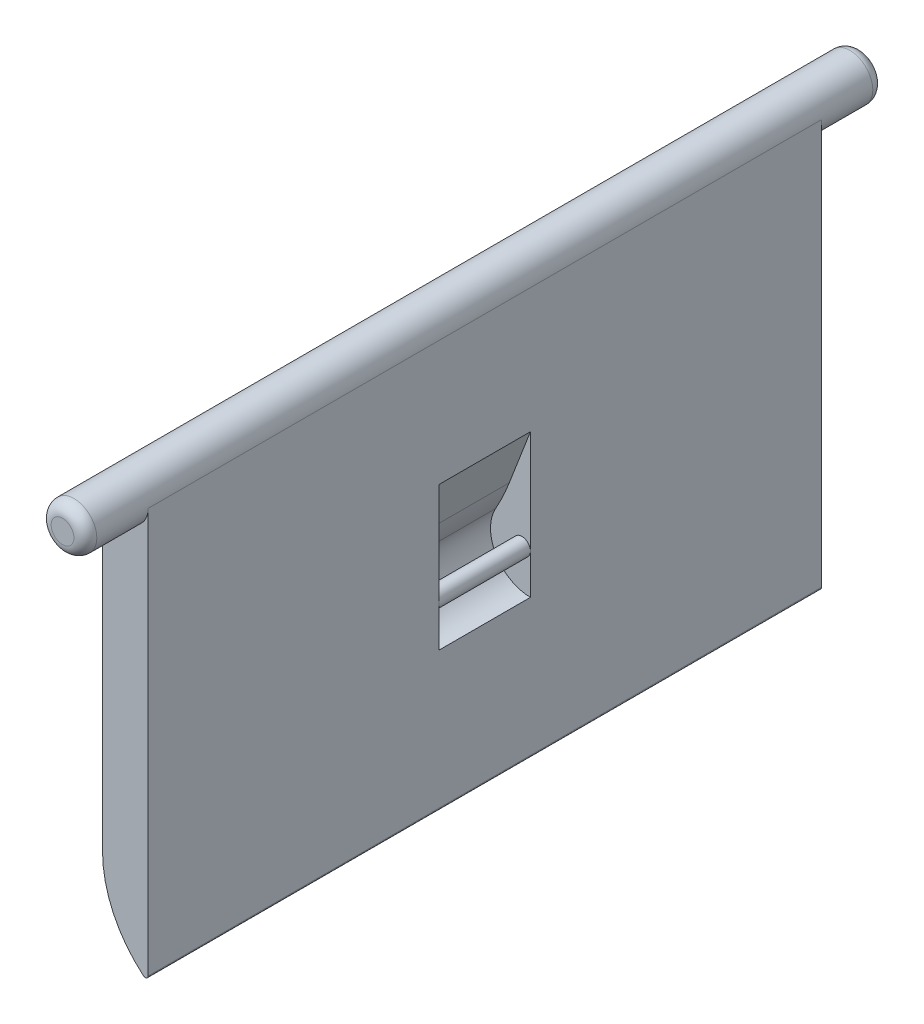
ISO-10303-21;
HEADER;
FILE_DESCRIPTION(('STEP AP214'),'2;1');
FILE_NAME('part.step','',(''),(''),'','','');
FILE_SCHEMA(('AUTOMOTIVE_DESIGN { 1 0 10303 214 1 1 1 1 }'));
ENDSEC;
DATA;
#1=APPLICATION_CONTEXT('core data for automotive mechanical design processes');
#2=APPLICATION_PROTOCOL_DEFINITION('international standard','automotive_design',2000,#1);
#3=PRODUCT_CONTEXT('',#1,'mechanical');
#4=PRODUCT('Part','Part','',(#3));
#5=PRODUCT_RELATED_PRODUCT_CATEGORY('part','',(#4));
#6=PRODUCT_DEFINITION_FORMATION('','',#4);
#7=PRODUCT_DEFINITION_CONTEXT('part definition',#1,'design');
#8=PRODUCT_DEFINITION('design','',#6,#7);
#9=PRODUCT_DEFINITION_SHAPE('','',#8);
#10=(LENGTH_UNIT() NAMED_UNIT(*) SI_UNIT(.MILLI.,.METRE.));
#11=(NAMED_UNIT(*) PLANE_ANGLE_UNIT() SI_UNIT($,.RADIAN.));
#12=(NAMED_UNIT(*) SI_UNIT($,.STERADIAN.) SOLID_ANGLE_UNIT());
#13=UNCERTAINTY_MEASURE_WITH_UNIT(LENGTH_MEASURE(1.E-05),#10,'distance_accuracy_value','');
#14=(GEOMETRIC_REPRESENTATION_CONTEXT(3) GLOBAL_UNCERTAINTY_ASSIGNED_CONTEXT((#13)) GLOBAL_UNIT_ASSIGNED_CONTEXT((#10,
#11,#12)) REPRESENTATION_CONTEXT('',''));
#15=CARTESIAN_POINT('',(0.,0.,0.));
#16=DIRECTION('',(0.,0.,1.));
#17=DIRECTION('',(1.,0.,0.));
#18=AXIS2_PLACEMENT_3D('',#15,#16,#17);
#19=CARTESIAN_POINT('',(2.,0.,29.5));
#20=DIRECTION('',(1.,0.,0.));
#21=DIRECTION('',(0.,1.,0.));
#22=AXIS2_PLACEMENT_3D('',#19,#20,#21);
#23=PLANE('',#22);
#24=DIRECTION('',(0.,-1.,0.));
#25=VECTOR('',#24,1.);
#26=CARTESIAN_POINT('',(2.,0.,4.));
#27=LINE('',#26,#25);
#28=CARTESIAN_POINT('',(2.,-10.9308214263915,4.));
#29=VERTEX_POINT('',#28);
#30=CARTESIAN_POINT('',(2.,-20.,4.));
#31=VERTEX_POINT('',#30);
#32=EDGE_CURVE('E119',#29,#31,#27,.T.);
#33=ORIENTED_EDGE('',*,*,#32,.F.);
#34=DIRECTION('',(0.,0.,-1.));
#35=VECTOR('',#34,1.);
#36=CARTESIAN_POINT('',(2.,-10.9308214263915,-4.));
#37=LINE('',#36,#35);
#38=CARTESIAN_POINT('',(2.,-10.9308214263915,-4.));
#39=VERTEX_POINT('',#38);
#40=EDGE_CURVE('E153',#29,#39,#37,.T.);
#41=ORIENTED_EDGE('',*,*,#40,.T.);
#42=DIRECTION('',(0.,-1.,0.));
#43=VECTOR('',#42,1.);
#44=CARTESIAN_POINT('',(2.,0.,-4.));
#45=LINE('',#44,#43);
#46=CARTESIAN_POINT('',(2.,-20.,-4.));
#47=VERTEX_POINT('',#46);
#48=EDGE_CURVE('E147',#39,#47,#45,.T.);
#49=ORIENTED_EDGE('',*,*,#48,.T.);
#50=CARTESIAN_POINT('',(2.,-23.5,-4.));
#51=VERTEX_POINT('',#50);
#52=EDGE_CURVE('E146',#47,#51,#45,.T.);
#53=ORIENTED_EDGE('',*,*,#52,.T.);
#54=DIRECTION('',(0.,0.,1.));
#55=VECTOR('',#54,1.);
#56=CARTESIAN_POINT('',(2.,-23.5,-4.));
#57=LINE('',#56,#55);
#58=CARTESIAN_POINT('',(2.,-23.5,4.));
#59=VERTEX_POINT('',#58);
#60=EDGE_CURVE('E130',#59,#51,#57,.F.);
#61=ORIENTED_EDGE('',*,*,#60,.F.);
#62=EDGE_CURVE('E131',#31,#59,#27,.T.);
#63=ORIENTED_EDGE('',*,*,#62,.F.);
#64=EDGE_LOOP('',(#33,#41,#49,#53,#61,#63));
#65=FACE_BOUND('',#64,.T.);
#66=DIRECTION('',(0.,-1.,0.));
#67=VECTOR('',#66,1.);
#68=CARTESIAN_POINT('',(2.,0.,29.5));
#69=LINE('',#68,#67);
#70=CARTESIAN_POINT('',(2.,0.,29.5));
#71=VERTEX_POINT('',#70);
#72=CARTESIAN_POINT('',(2.,-35.4833147735479,29.5));
#73=VERTEX_POINT('',#72);
#74=EDGE_CURVE('E197',#71,#73,#69,.T.);
#75=ORIENTED_EDGE('',*,*,#74,.T.);
#76=DIRECTION('',(0.,0.,1.));
#77=VECTOR('',#76,1.);
#78=CARTESIAN_POINT('',(2.,-35.4833147735479,-29.5));
#79=LINE('',#78,#77);
#80=CARTESIAN_POINT('',(2.,-35.4833147735479,-29.5));
#81=VERTEX_POINT('',#80);
#82=EDGE_CURVE('E241',#73,#81,#79,.F.);
#83=ORIENTED_EDGE('',*,*,#82,.T.);
#84=DIRECTION('',(0.,-1.,0.));
#85=VECTOR('',#84,1.);
#86=CARTESIAN_POINT('',(2.,0.,-29.5));
#87=LINE('',#86,#85);
#88=CARTESIAN_POINT('',(2.,0.,-29.5));
#89=VERTEX_POINT('',#88);
#90=EDGE_CURVE('E190',#89,#81,#87,.T.);
#91=ORIENTED_EDGE('',*,*,#90,.F.);
#92=DIRECTION('',(0.,0.,-1.));
#93=VECTOR('',#92,1.);
#94=CARTESIAN_POINT('',(2.,0.,29.5));
#95=LINE('',#94,#93);
#96=EDGE_CURVE('E201',#71,#89,#95,.T.);
#97=ORIENTED_EDGE('',*,*,#96,.F.);
#98=EDGE_LOOP('',(#75,#83,#91,#97));
#99=FACE_BOUND('',#98,.T.);
#100=ADVANCED_FACE('F43',(#65,#99),#23,.T.);
#101=CARTESIAN_POINT('',(-2.,0.,29.5));
#102=DIRECTION('',(1.,0.,0.));
#103=DIRECTION('',(0.,1.,0.));
#104=AXIS2_PLACEMENT_3D('',#101,#102,#103);
#105=PLANE('',#104);
#106=DIRECTION('',(0.,-1.,0.));
#107=VECTOR('',#106,1.);
#108=CARTESIAN_POINT('',(-2.,0.,-29.5));
#109=LINE('',#108,#107);
#110=CARTESIAN_POINT('',(-2.,0.,-29.5));
#111=VERTEX_POINT('',#110);
#112=CARTESIAN_POINT('',(-2.,-28.,-29.5));
#113=VERTEX_POINT('',#112);
#114=EDGE_CURVE('E205',#111,#113,#109,.T.);
#115=ORIENTED_EDGE('',*,*,#114,.T.);
#116=DIRECTION('',(0.,0.,-1.));
#117=VECTOR('',#116,1.);
#118=CARTESIAN_POINT('',(-2.,-28.,29.5));
#119=LINE('',#118,#117);
#120=CARTESIAN_POINT('',(-2.,-28.,29.5));
#121=VERTEX_POINT('',#120);
#122=EDGE_CURVE('E217',#121,#113,#119,.T.);
#123=ORIENTED_EDGE('',*,*,#122,.F.);
#124=DIRECTION('',(0.,-1.,0.));
#125=VECTOR('',#124,1.);
#126=CARTESIAN_POINT('',(-2.,0.,29.5));
#127=LINE('',#126,#125);
#128=CARTESIAN_POINT('',(-2.,0.,29.5));
#129=VERTEX_POINT('',#128);
#130=EDGE_CURVE('E189',#129,#121,#127,.T.);
#131=ORIENTED_EDGE('',*,*,#130,.F.);
#132=DIRECTION('',(0.,0.,-1.));
#133=VECTOR('',#132,1.);
#134=CARTESIAN_POINT('',(-2.,0.,29.5));
#135=LINE('',#134,#133);
#136=EDGE_CURVE('E221',#129,#111,#135,.T.);
#137=ORIENTED_EDGE('',*,*,#136,.T.);
#138=EDGE_LOOP('',(#115,#123,#131,#137));
#139=FACE_BOUND('',#138,.T.);
#140=ADVANCED_FACE('F271',(#139),#105,.F.);
#141=CARTESIAN_POINT('',(8.,-28.,29.5));
#142=DIRECTION('',(0.,0.,-1.));
#143=DIRECTION('',(-1.,0.,0.));
#144=AXIS2_PLACEMENT_3D('',#141,#142,#143);
#145=CYLINDRICAL_SURFACE('',#144,10.);
#146=CARTESIAN_POINT('',(8.,-28.,-29.5));
#147=DIRECTION('',(0.,0.,1.));
#148=DIRECTION('',(1.,0.,0.));
#149=AXIS2_PLACEMENT_3D('',#146,#147,#148);
#150=CIRCLE('',#149,10.);
#151=CARTESIAN_POINT('',(1.5897435897436,-35.6751946395363,-29.5));
#152=VERTEX_POINT('',#151);
#153=EDGE_CURVE('E208',#113,#152,#150,.T.);
#154=ORIENTED_EDGE('',*,*,#153,.T.);
#155=DIRECTION('',(0.,0.,-1.));
#156=VECTOR('',#155,1.);
#157=CARTESIAN_POINT('',(1.5897435897436,-35.6751946395363,29.5));
#158=LINE('',#157,#156);
#159=CARTESIAN_POINT('',(1.5897435897436,-35.6751946395363,29.5));
#160=VERTEX_POINT('',#159);
#161=EDGE_CURVE('E140',#152,#160,#158,.F.);
#162=ORIENTED_EDGE('',*,*,#161,.T.);
#163=CARTESIAN_POINT('',(8.,-28.,29.5));
#164=DIRECTION('',(0.,0.,1.));
#165=DIRECTION('',(1.,0.,0.));
#166=AXIS2_PLACEMENT_3D('',#163,#164,#165);
#167=CIRCLE('',#166,10.);
#168=EDGE_CURVE('E193',#121,#160,#167,.T.);
#169=ORIENTED_EDGE('',*,*,#168,.F.);
#170=ORIENTED_EDGE('',*,*,#122,.T.);
#171=EDGE_LOOP('',(#154,#162,#169,#170));
#172=FACE_BOUND('',#171,.T.);
#173=ADVANCED_FACE('F251',(#172),#145,.T.);
#174=CARTESIAN_POINT('',(0.,0.,29.5));
#175=DIRECTION('',(0.,0.,1.));
#176=DIRECTION('',(1.,0.,0.));
#177=AXIS2_PLACEMENT_3D('',#174,#175,#176);
#178=PLANE('',#177);
#179=ORIENTED_EDGE('',*,*,#168,.T.);
#180=CARTESIAN_POINT('',(1.75,-35.4833147735479,29.5));
#181=DIRECTION('',(0.,0.,1.));
#182=DIRECTION('',(1.,0.,0.));
#183=AXIS2_PLACEMENT_3D('',#180,#181,#182);
#184=CIRCLE('',#183,0.25);
#185=EDGE_CURVE('E138',#160,#73,#184,.T.);
#186=ORIENTED_EDGE('',*,*,#185,.T.);
#187=ORIENTED_EDGE('',*,*,#74,.F.);
#188=CARTESIAN_POINT('',(0.,0.,29.5));
#189=DIRECTION('',(0.,0.,1.));
#190=DIRECTION('',(1.,0.,0.));
#191=AXIS2_PLACEMENT_3D('',#188,#189,#190);
#192=CIRCLE('',#191,2.);
#193=EDGE_CURVE('E186',#129,#71,#192,.T.);
#194=ORIENTED_EDGE('',*,*,#193,.F.);
#195=ORIENTED_EDGE('',*,*,#130,.T.);
#196=EDGE_LOOP('',(#179,#186,#187,#194,#195));
#197=FACE_BOUND('',#196,.T.);
#198=ADVANCED_FACE('F256',(#197),#178,.T.);
#199=CARTESIAN_POINT('',(0.,0.,-29.5));
#200=DIRECTION('',(0.,0.,1.));
#201=DIRECTION('',(1.,0.,0.));
#202=AXIS2_PLACEMENT_3D('',#199,#200,#201);
#203=PLANE('',#202);
#204=ORIENTED_EDGE('',*,*,#90,.T.);
#205=CARTESIAN_POINT('',(1.75,-35.4833147735479,-29.5));
#206=DIRECTION('',(0.,0.,1.));
#207=DIRECTION('',(1.,0.,0.));
#208=AXIS2_PLACEMENT_3D('',#205,#206,#207);
#209=CIRCLE('',#208,0.25);
#210=EDGE_CURVE('E245',#81,#152,#209,.F.);
#211=ORIENTED_EDGE('',*,*,#210,.T.);
#212=ORIENTED_EDGE('',*,*,#153,.F.);
#213=ORIENTED_EDGE('',*,*,#114,.F.);
#214=CARTESIAN_POINT('',(0.,0.,-29.5));
#215=DIRECTION('',(0.,0.,1.));
#216=DIRECTION('',(1.,0.,0.));
#217=AXIS2_PLACEMENT_3D('',#214,#215,#216);
#218=CIRCLE('',#217,2.);
#219=EDGE_CURVE('E182',#111,#89,#218,.T.);
#220=ORIENTED_EDGE('',*,*,#219,.T.);
#221=EDGE_LOOP('',(#204,#211,#212,#213,#220));
#222=FACE_BOUND('',#221,.T.);
#223=ADVANCED_FACE('F266',(#222),#203,.F.);
#224=CARTESIAN_POINT('',(0.,0.,35.));
#225=DIRECTION('',(0.,0.,-1.));
#226=DIRECTION('',(-1.,0.,0.));
#227=AXIS2_PLACEMENT_3D('',#224,#225,#226);
#228=CYLINDRICAL_SURFACE('',#227,2.);
#229=CARTESIAN_POINT('',(0.,0.,-34.));
#230=DIRECTION('',(0.,0.,1.));
#231=DIRECTION('',(1.,0.,0.));
#232=AXIS2_PLACEMENT_3D('',#229,#230,#231);
#233=CIRCLE('',#232,2.);
#234=CARTESIAN_POINT('',(2.,0.,-34.));
#235=VERTEX_POINT('',#234);
#236=EDGE_CURVE('E229',#235,#235,#233,.T.);
#237=ORIENTED_EDGE('',*,*,#236,.T.);
#238=EDGE_LOOP('',(#237));
#239=FACE_BOUND('',#238,.T.);
#240=CARTESIAN_POINT('',(0.,0.,34.));
#241=DIRECTION('',(0.,0.,1.));
#242=DIRECTION('',(1.,0.,0.));
#243=AXIS2_PLACEMENT_3D('',#240,#241,#242);
#244=CIRCLE('',#243,2.);
#245=CARTESIAN_POINT('',(2.,0.,34.));
#246=VERTEX_POINT('',#245);
#247=EDGE_CURVE('E225',#246,#246,#244,.F.);
#248=ORIENTED_EDGE('',*,*,#247,.T.);
#249=EDGE_LOOP('',(#248));
#250=FACE_BOUND('',#249,.T.);
#251=ORIENTED_EDGE('',*,*,#193,.T.);
#252=ORIENTED_EDGE('',*,*,#96,.T.);
#253=ORIENTED_EDGE('',*,*,#219,.F.);
#254=ORIENTED_EDGE('',*,*,#136,.F.);
#255=EDGE_LOOP('',(#251,#252,#253,#254));
#256=FACE_BOUND('',#255,.T.);
#257=ADVANCED_FACE('F269',(#239,#250,#256),#228,.T.);
#258=CARTESIAN_POINT('',(0.,0.,35.));
#259=DIRECTION('',(0.,0.,1.));
#260=DIRECTION('',(1.,0.,0.));
#261=AXIS2_PLACEMENT_3D('',#258,#259,#260);
#262=PLANE('',#261);
#263=CARTESIAN_POINT('',(0.,0.,35.));
#264=DIRECTION('',(0.,0.,1.));
#265=DIRECTION('',(1.,0.,0.));
#266=AXIS2_PLACEMENT_3D('',#263,#264,#265);
#267=CIRCLE('',#266,1.);
#268=CARTESIAN_POINT('',(1.,0.,35.));
#269=VERTEX_POINT('',#268);
#270=EDGE_CURVE('E237',#269,#269,#267,.T.);
#271=ORIENTED_EDGE('',*,*,#270,.T.);
#272=EDGE_LOOP('',(#271));
#273=FACE_BOUND('',#272,.T.);
#274=ADVANCED_FACE('F316',(#273),#262,.T.);
#275=CARTESIAN_POINT('',(0.,0.,-35.));
#276=DIRECTION('',(0.,0.,1.));
#277=DIRECTION('',(1.,0.,0.));
#278=AXIS2_PLACEMENT_3D('',#275,#276,#277);
#279=PLANE('',#278);
#280=CARTESIAN_POINT('',(0.,0.,-35.));
#281=DIRECTION('',(0.,0.,1.));
#282=DIRECTION('',(1.,0.,0.));
#283=AXIS2_PLACEMENT_3D('',#280,#281,#282);
#284=CIRCLE('',#283,1.);
#285=CARTESIAN_POINT('',(1.,0.,-35.));
#286=VERTEX_POINT('',#285);
#287=EDGE_CURVE('E233',#286,#286,#284,.F.);
#288=ORIENTED_EDGE('',*,*,#287,.T.);
#289=EDGE_LOOP('',(#288));
#290=FACE_BOUND('',#289,.T.);
#291=ADVANCED_FACE('F285',(#290),#279,.F.);
#292=CARTESIAN_POINT('',(0.,0.,-34.));
#293=DIRECTION('',(0.,0.,1.));
#294=DIRECTION('',(1.,0.,0.));
#295=AXIS2_PLACEMENT_3D('',#292,#293,#294);
#296=DEGENERATE_TOROIDAL_SURFACE('',#295,1.,1.,.T.);
#297=ORIENTED_EDGE('',*,*,#287,.F.);
#298=EDGE_LOOP('',(#297));
#299=FACE_BOUND('',#298,.T.);
#300=ORIENTED_EDGE('',*,*,#236,.F.);
#301=EDGE_LOOP('',(#300));
#302=FACE_BOUND('',#301,.T.);
#303=ADVANCED_FACE('F281',(#299,#302),#296,.T.);
#304=CARTESIAN_POINT('',(0.,0.,34.));
#305=DIRECTION('',(0.,0.,1.));
#306=DIRECTION('',(1.,0.,0.));
#307=AXIS2_PLACEMENT_3D('',#304,#305,#306);
#308=DEGENERATE_TOROIDAL_SURFACE('',#307,1.,1.,.T.);
#309=ORIENTED_EDGE('',*,*,#247,.F.);
#310=EDGE_LOOP('',(#309));
#311=FACE_BOUND('',#310,.T.);
#312=ORIENTED_EDGE('',*,*,#270,.F.);
#313=EDGE_LOOP('',(#312));
#314=FACE_BOUND('',#313,.T.);
#315=ADVANCED_FACE('F284',(#311,#314),#308,.T.);
#316=CARTESIAN_POINT('',(1.75,-35.4833147735479,29.5));
#317=DIRECTION('',(0.,0.,-1.));
#318=DIRECTION('',(-1.,0.,0.));
#319=AXIS2_PLACEMENT_3D('',#316,#317,#318);
#320=CYLINDRICAL_SURFACE('',#319,0.25);
#321=ORIENTED_EDGE('',*,*,#185,.F.);
#322=ORIENTED_EDGE('',*,*,#161,.F.);
#323=ORIENTED_EDGE('',*,*,#210,.F.);
#324=ORIENTED_EDGE('',*,*,#82,.F.);
#325=EDGE_LOOP('',(#321,#322,#323,#324));
#326=FACE_BOUND('',#325,.T.);
#327=ADVANCED_FACE('F262',(#326),#320,.T.);
#328=CARTESIAN_POINT('',(2.,-20.,-4.));
#329=DIRECTION('',(0.,0.,1.));
#330=DIRECTION('',(1.,0.,0.));
#331=AXIS2_PLACEMENT_3D('',#328,#329,#330);
#332=CYLINDRICAL_SURFACE('',#331,3.5);
#333=CARTESIAN_POINT('',(2.,-20.,-4.));
#334=DIRECTION('',(0.,0.,1.));
#335=DIRECTION('',(1.,0.,0.));
#336=AXIS2_PLACEMENT_3D('',#333,#334,#335);
#337=CIRCLE('',#336,3.5);
#338=CARTESIAN_POINT('',(-1.05500252703307,-18.2920891241574,-4.));
#339=VERTEX_POINT('',#338);
#340=EDGE_CURVE('E174',#339,#51,#337,.T.);
#341=ORIENTED_EDGE('',*,*,#340,.F.);
#342=DIRECTION('',(0.,0.,1.));
#343=VECTOR('',#342,1.);
#344=CARTESIAN_POINT('',(-1.05500252703307,-18.2920891241574,-4.));
#345=LINE('',#344,#343);
#346=CARTESIAN_POINT('',(-1.05500252703307,-18.2920891241574,4.));
#347=VERTEX_POINT('',#346);
#348=EDGE_CURVE('E161',#339,#347,#345,.T.);
#349=ORIENTED_EDGE('',*,*,#348,.T.);
#350=CARTESIAN_POINT('',(2.,-20.,4.));
#351=DIRECTION('',(0.,0.,1.));
#352=DIRECTION('',(1.,0.,0.));
#353=AXIS2_PLACEMENT_3D('',#350,#351,#352);
#354=CIRCLE('',#353,3.5);
#355=EDGE_CURVE('E176',#347,#59,#354,.T.);
#356=ORIENTED_EDGE('',*,*,#355,.T.);
#357=ORIENTED_EDGE('',*,*,#60,.T.);
#358=EDGE_LOOP('',(#341,#349,#356,#357));
#359=FACE_BOUND('',#358,.T.);
#360=ADVANCED_FACE('F173',(#359),#332,.F.);
#361=CARTESIAN_POINT('',(2.,-20.,-4.));
#362=DIRECTION('',(0.,0.,1.));
#363=DIRECTION('',(1.,0.,0.));
#364=AXIS2_PLACEMENT_3D('',#361,#362,#363);
#365=PLANE('',#364);
#366=ORIENTED_EDGE('',*,*,#52,.F.);
#367=CARTESIAN_POINT('',(1.25,-20.,-4.));
#368=DIRECTION('',(0.,0.,1.));
#369=DIRECTION('',(1.,0.,0.));
#370=AXIS2_PLACEMENT_3D('',#367,#368,#369);
#371=CIRCLE('',#370,0.750000000000001);
#372=EDGE_CURVE('E178',#47,#47,#371,.F.);
#373=ORIENTED_EDGE('',*,*,#372,.T.);
#374=ORIENTED_EDGE('',*,*,#48,.F.);
#375=DIRECTION('',(0.360041149911554,0.932936423541479,0.));
#376=VECTOR('',#375,1.);
#377=CARTESIAN_POINT('',(-0.592592592592624,-17.6487314809163,-4.));
#378=LINE('',#377,#376);
#379=CARTESIAN_POINT('',(0.146568646464678,-15.7334214032877,-4.));
#380=VERTEX_POINT('',#379);
#381=EDGE_CURVE('E158',#39,#380,#378,.F.);
#382=ORIENTED_EDGE('',*,*,#381,.T.);
#383=CARTESIAN_POINT('',(-18.5121598243649,-8.53259840505662,-4.));
#384=DIRECTION('',(0.,0.,1.));
#385=DIRECTION('',(1.,0.,0.));
#386=AXIS2_PLACEMENT_3D('',#383,#384,#385);
#387=CIRCLE('',#386,20.);
#388=EDGE_CURVE('E11',#380,#339,#387,.F.);
#389=ORIENTED_EDGE('',*,*,#388,.T.);
#390=ORIENTED_EDGE('',*,*,#340,.T.);
#391=EDGE_LOOP('',(#366,#373,#374,#382,#389,#390));
#392=FACE_BOUND('',#391,.T.);
#393=ADVANCED_FACE('F305',(#392),#365,.T.);
#394=CARTESIAN_POINT('',(2.,-20.,4.));
#395=DIRECTION('',(0.,0.,1.));
#396=DIRECTION('',(1.,0.,0.));
#397=AXIS2_PLACEMENT_3D('',#394,#395,#396);
#398=PLANE('',#397);
#399=ORIENTED_EDGE('',*,*,#32,.T.);
#400=CARTESIAN_POINT('',(1.25,-20.,4.));
#401=DIRECTION('',(0.,0.,1.));
#402=DIRECTION('',(1.,0.,0.));
#403=AXIS2_PLACEMENT_3D('',#400,#401,#402);
#404=CIRCLE('',#403,0.750000000000001);
#405=EDGE_CURVE('E124',#31,#31,#404,.F.);
#406=ORIENTED_EDGE('',*,*,#405,.F.);
#407=ORIENTED_EDGE('',*,*,#62,.T.);
#408=ORIENTED_EDGE('',*,*,#355,.F.);
#409=CARTESIAN_POINT('',(-18.5121598243649,-8.53259840505662,4.));
#410=DIRECTION('',(0.,0.,1.));
#411=DIRECTION('',(1.,0.,0.));
#412=AXIS2_PLACEMENT_3D('',#409,#410,#411);
#413=CIRCLE('',#412,20.);
#414=CARTESIAN_POINT('',(0.146568646464678,-15.7334214032877,4.));
#415=VERTEX_POINT('',#414);
#416=EDGE_CURVE('E52',#347,#415,#413,.T.);
#417=ORIENTED_EDGE('',*,*,#416,.T.);
#418=DIRECTION('',(-0.360041149911554,-0.932936423541479,0.));
#419=VECTOR('',#418,1.);
#420=CARTESIAN_POINT('',(-1.04629629629631,-18.8243657404581,4.));
#421=LINE('',#420,#419);
#422=EDGE_CURVE('E125',#415,#29,#421,.F.);
#423=ORIENTED_EDGE('',*,*,#422,.T.);
#424=EDGE_LOOP('',(#399,#406,#407,#408,#417,#423));
#425=FACE_BOUND('',#424,.T.);
#426=ADVANCED_FACE('F121',(#425),#398,.F.);
#427=CARTESIAN_POINT('',(1.25,-20.,5.));
#428=DIRECTION('',(0.,0.,-1.));
#429=DIRECTION('',(-1.,0.,0.));
#430=AXIS2_PLACEMENT_3D('',#427,#428,#429);
#431=CYLINDRICAL_SURFACE('',#430,0.750000000000001);
#432=ORIENTED_EDGE('',*,*,#372,.F.);
#433=EDGE_LOOP('',(#432));
#434=FACE_BOUND('',#433,.T.);
#435=ORIENTED_EDGE('',*,*,#405,.T.);
#436=EDGE_LOOP('',(#435));
#437=FACE_BOUND('',#436,.T.);
#438=ADVANCED_FACE('F296',(#434,#437),#431,.T.);
#439=CARTESIAN_POINT('',(-0.592592592592624,-17.6487314809163,-4.));
#440=DIRECTION('',(-0.932936423541479,0.360041149911554,0.));
#441=DIRECTION('',(0.,0.,1.));
#442=AXIS2_PLACEMENT_3D('',#439,#440,#441);
#443=PLANE('',#442);
#444=ORIENTED_EDGE('',*,*,#422,.F.);
#445=DIRECTION('',(0.,0.,1.));
#446=VECTOR('',#445,1.);
#447=CARTESIAN_POINT('',(0.146568646464677,-15.7334214032877,-4.));
#448=LINE('',#447,#446);
#449=EDGE_CURVE('E65',#415,#380,#448,.F.);
#450=ORIENTED_EDGE('',*,*,#449,.T.);
#451=ORIENTED_EDGE('',*,*,#381,.F.);
#452=ORIENTED_EDGE('',*,*,#40,.F.);
#453=EDGE_LOOP('',(#444,#450,#451,#452));
#454=FACE_BOUND('',#453,.T.);
#455=ADVANCED_FACE('F292',(#454),#443,.F.);
#456=CARTESIAN_POINT('',(-18.5121598243649,-8.53259840505662,-4.));
#457=DIRECTION('',(0.,0.,1.));
#458=DIRECTION('',(1.,0.,0.));
#459=AXIS2_PLACEMENT_3D('',#456,#457,#458);
#460=CYLINDRICAL_SURFACE('',#459,20.);
#461=ORIENTED_EDGE('',*,*,#388,.F.);
#462=ORIENTED_EDGE('',*,*,#449,.F.);
#463=ORIENTED_EDGE('',*,*,#416,.F.);
#464=ORIENTED_EDGE('',*,*,#348,.F.);
#465=EDGE_LOOP('',(#461,#462,#463,#464));
#466=FACE_BOUND('',#465,.T.);
#467=ADVANCED_FACE('F45',(#466),#460,.T.);
#468=CLOSED_SHELL('',(#100,#140,#173,#198,#223,#257,#274,#291,#303,#315,#327,#360,#393,#426,
#438,#455,#467));
#469=MANIFOLD_SOLID_BREP('B2',#468);
#470=ADVANCED_BREP_SHAPE_REPRESENTATION('',(#18,#469),#14);
#471=SHAPE_DEFINITION_REPRESENTATION(#9,#470);
ENDSEC;
END-ISO-10303-21;
